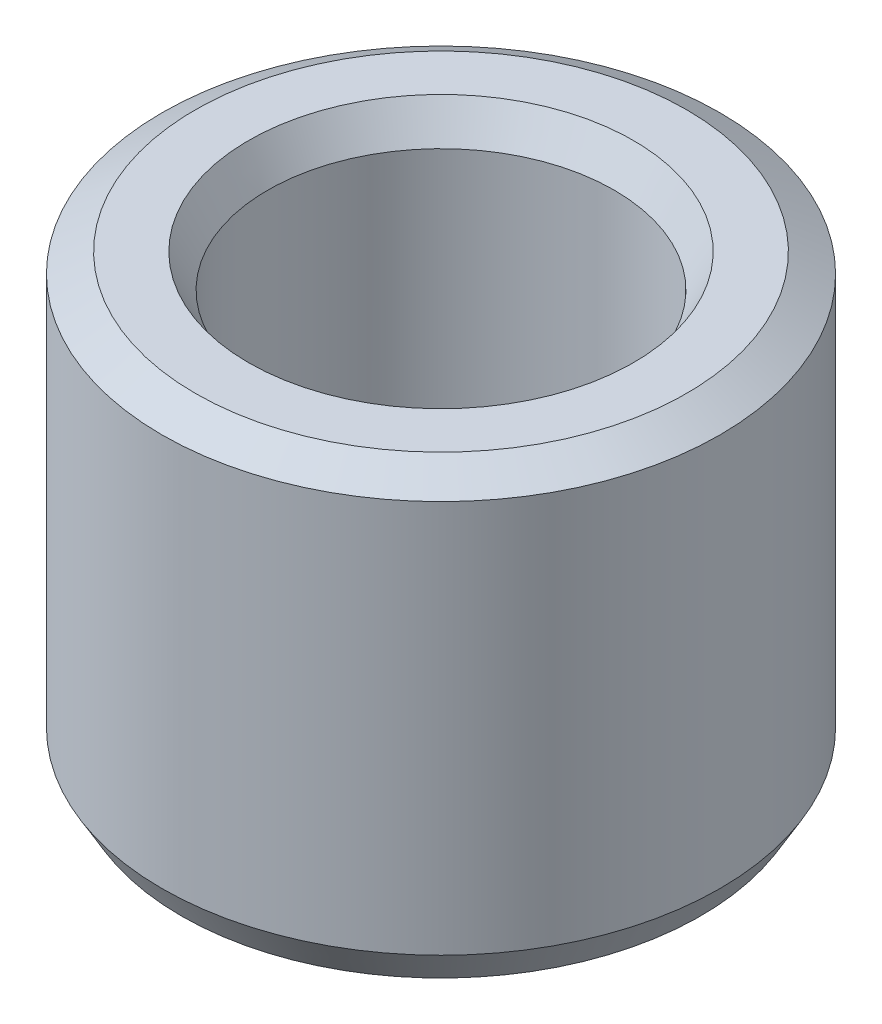
ISO-10303-21;
HEADER;
FILE_DESCRIPTION(('STEP AP214'),'2;1');
FILE_NAME('part.step','',(''),(''),'','','');
FILE_SCHEMA(('AUTOMOTIVE_DESIGN { 1 0 10303 214 1 1 1 1 }'));
ENDSEC;
DATA;
#1=APPLICATION_CONTEXT('core data for automotive mechanical design processes');
#2=APPLICATION_PROTOCOL_DEFINITION('international standard','automotive_design',2000,#1);
#3=PRODUCT_CONTEXT('',#1,'mechanical');
#4=PRODUCT('Part','Part','',(#3));
#5=PRODUCT_RELATED_PRODUCT_CATEGORY('part','',(#4));
#6=PRODUCT_DEFINITION_FORMATION('','',#4);
#7=PRODUCT_DEFINITION_CONTEXT('part definition',#1,'design');
#8=PRODUCT_DEFINITION('design','',#6,#7);
#9=PRODUCT_DEFINITION_SHAPE('','',#8);
#10=(LENGTH_UNIT() NAMED_UNIT(*) SI_UNIT(.MILLI.,.METRE.));
#11=(NAMED_UNIT(*) PLANE_ANGLE_UNIT() SI_UNIT($,.RADIAN.));
#12=(NAMED_UNIT(*) SI_UNIT($,.STERADIAN.) SOLID_ANGLE_UNIT());
#13=UNCERTAINTY_MEASURE_WITH_UNIT(LENGTH_MEASURE(1.E-05),#10,'distance_accuracy_value','');
#14=(GEOMETRIC_REPRESENTATION_CONTEXT(3) GLOBAL_UNCERTAINTY_ASSIGNED_CONTEXT((#13)) GLOBAL_UNIT_ASSIGNED_CONTEXT((#10,
#11,#12)) REPRESENTATION_CONTEXT('',''));
#15=CARTESIAN_POINT('',(0.,0.,0.));
#16=DIRECTION('',(0.,0.,1.));
#17=DIRECTION('',(1.,0.,0.));
#18=AXIS2_PLACEMENT_3D('',#15,#16,#17);
#19=CARTESIAN_POINT('',(0.,39.9164613721389,0.));
#20=DIRECTION('',(0.,-1.,0.));
#21=DIRECTION('',(0.,0.,-1.));
#22=AXIS2_PLACEMENT_3D('',#19,#20,#21);
#23=CYLINDRICAL_SURFACE('',#22,25.);
#24=CARTESIAN_POINT('',(0.,2.98852457543011,0.));
#25=DIRECTION('',(0.,1.,0.));
#26=DIRECTION('',(0.,0.,1.));
#27=AXIS2_PLACEMENT_3D('',#24,#25,#26);
#28=CIRCLE('',#27,25.);
#29=CARTESIAN_POINT('',(0.,2.98852457543011,25.));
#30=VERTEX_POINT('',#29);
#31=EDGE_CURVE('E10',#30,#30,#28,.T.);
#32=ORIENTED_EDGE('',*,*,#31,.T.);
#33=EDGE_LOOP('',(#32));
#34=FACE_BOUND('',#33,.T.);
#35=CARTESIAN_POINT('',(0.,38.1910359040345,0.));
#36=DIRECTION('',(0.,1.,0.));
#37=DIRECTION('',(0.,0.,1.));
#38=AXIS2_PLACEMENT_3D('',#35,#36,#37);
#39=CIRCLE('',#38,25.);
#40=CARTESIAN_POINT('',(0.,38.1910359040345,-25.));
#41=VERTEX_POINT('',#40);
#42=EDGE_CURVE('E50',#41,#41,#39,.F.);
#43=ORIENTED_EDGE('',*,*,#42,.T.);
#44=EDGE_LOOP('',(#43));
#45=FACE_BOUND('',#44,.T.);
#46=ADVANCED_FACE('F39',(#34,#45),#23,.T.);
#47=CARTESIAN_POINT('',(0.,39.9164613721389,0.));
#48=DIRECTION('',(0.,1.,0.));
#49=DIRECTION('',(0.,0.,1.));
#50=AXIS2_PLACEMENT_3D('',#47,#48,#49);
#51=PLANE('',#50);
#52=CARTESIAN_POINT('',(0.,39.9164613721389,0.));
#53=DIRECTION('',(0.,1.,0.));
#54=DIRECTION('',(0.,0.,1.));
#55=AXIS2_PLACEMENT_3D('',#52,#53,#54);
#56=CIRCLE('',#55,17.2464005370446);
#57=CARTESIAN_POINT('',(0.,39.9164613721389,17.2464005370446));
#58=VERTEX_POINT('',#57);
#59=EDGE_CURVE('E58',#58,#58,#56,.F.);
#60=ORIENTED_EDGE('',*,*,#59,.T.);
#61=EDGE_LOOP('',(#60));
#62=FACE_BOUND('',#61,.T.);
#63=CARTESIAN_POINT('',(0.,39.9164613721389,0.));
#64=DIRECTION('',(0.,1.,0.));
#65=DIRECTION('',(0.,0.,1.));
#66=AXIS2_PLACEMENT_3D('',#63,#64,#65);
#67=CIRCLE('',#66,22.0114754245699);
#68=CARTESIAN_POINT('',(0.,39.9164613721389,-22.0114754245699));
#69=VERTEX_POINT('',#68);
#70=EDGE_CURVE('E61',#69,#69,#67,.T.);
#71=ORIENTED_EDGE('',*,*,#70,.T.);
#72=EDGE_LOOP('',(#71));
#73=FACE_BOUND('',#72,.T.);
#74=ADVANCED_FACE('F88',(#62,#73),#51,.T.);
#75=CARTESIAN_POINT('',(0.,0.,0.));
#76=DIRECTION('',(0.,1.,0.));
#77=DIRECTION('',(0.,0.,1.));
#78=AXIS2_PLACEMENT_3D('',#75,#76,#77);
#79=PLANE('',#78);
#80=CARTESIAN_POINT('',(0.,0.,0.));
#81=DIRECTION('',(0.,1.,0.));
#82=DIRECTION('',(0.,0.,1.));
#83=AXIS2_PLACEMENT_3D('',#80,#81,#82);
#84=CIRCLE('',#83,18.5094996443703);
#85=CARTESIAN_POINT('',(0.,0.,-18.5094996443703));
#86=VERTEX_POINT('',#85);
#87=EDGE_CURVE('E51',#86,#86,#84,.T.);
#88=ORIENTED_EDGE('',*,*,#87,.T.);
#89=EDGE_LOOP('',(#88));
#90=FACE_BOUND('',#89,.T.);
#91=CARTESIAN_POINT('',(0.,0.,0.));
#92=DIRECTION('',(0.,1.,0.));
#93=DIRECTION('',(0.,0.,1.));
#94=AXIS2_PLACEMENT_3D('',#91,#92,#93);
#95=CIRCLE('',#94,23.2745745318956);
#96=CARTESIAN_POINT('',(0.,0.,23.2745745318956));
#97=VERTEX_POINT('',#96);
#98=EDGE_CURVE('E54',#97,#97,#95,.F.);
#99=ORIENTED_EDGE('',*,*,#98,.T.);
#100=EDGE_LOOP('',(#99));
#101=FACE_BOUND('',#100,.T.);
#102=ADVANCED_FACE('F83',(#90,#101),#79,.F.);
#103=CARTESIAN_POINT('',(0.,39.9164613721389,0.));
#104=DIRECTION('',(0.,-1.,0.));
#105=DIRECTION('',(0.,0.,-1.));
#106=AXIS2_PLACEMENT_3D('',#103,#104,#105);
#107=CYLINDRICAL_SURFACE('',#106,15.5209750689402);
#108=CARTESIAN_POINT('',(0.,36.9279367967088,0.));
#109=DIRECTION('',(0.,1.,0.));
#110=DIRECTION('',(0.,0.,1.));
#111=AXIS2_PLACEMENT_3D('',#108,#109,#110);
#112=CIRCLE('',#111,15.5209750689402);
#113=CARTESIAN_POINT('',(0.,36.9279367967088,15.5209750689402));
#114=VERTEX_POINT('',#113);
#115=EDGE_CURVE('E67',#114,#114,#112,.T.);
#116=ORIENTED_EDGE('',*,*,#115,.T.);
#117=EDGE_LOOP('',(#116));
#118=FACE_BOUND('',#117,.T.);
#119=CARTESIAN_POINT('',(0.,1.7254254681044,0.));
#120=DIRECTION('',(0.,1.,0.));
#121=DIRECTION('',(0.,0.,1.));
#122=AXIS2_PLACEMENT_3D('',#119,#120,#121);
#123=CIRCLE('',#122,15.5209750689402);
#124=CARTESIAN_POINT('',(0.,1.7254254681044,-15.5209750689402));
#125=VERTEX_POINT('',#124);
#126=EDGE_CURVE('E69',#125,#125,#123,.F.);
#127=ORIENTED_EDGE('',*,*,#126,.T.);
#128=EDGE_LOOP('',(#127));
#129=FACE_BOUND('',#128,.T.);
#130=ADVANCED_FACE('F71',(#118,#129),#107,.F.);
#131=CARTESIAN_POINT('',(0.,36.9279367967088,0.));
#132=DIRECTION('',(0.,1.,0.));
#133=DIRECTION('',(0.,0.,1.));
#134=AXIS2_PLACEMENT_3D('',#131,#132,#133);
#135=CONICAL_SURFACE('',#134,15.5209750689402,0.523598775598301);
#136=ORIENTED_EDGE('',*,*,#59,.F.);
#137=EDGE_LOOP('',(#136));
#138=FACE_BOUND('',#137,.T.);
#139=ORIENTED_EDGE('',*,*,#115,.F.);
#140=EDGE_LOOP('',(#139));
#141=FACE_BOUND('',#140,.T.);
#142=ADVANCED_FACE('F77',(#138,#141),#135,.F.);
#143=CARTESIAN_POINT('',(0.,0.,0.));
#144=DIRECTION('',(0.,-1.,0.));
#145=DIRECTION('',(0.,0.,-1.));
#146=AXIS2_PLACEMENT_3D('',#143,#144,#145);
#147=CONICAL_SURFACE('',#146,18.5094996443703,1.04719755119659);
#148=CARTESIAN_POINT('',(0.,1.7254254681044,-15.5209750689402));
#149=CARTESIAN_POINT('',(0.,1.70745228614498,-15.5521055332676));
#150=CARTESIAN_POINT('',(0.,1.68947910418556,-15.583235997595));
#151=CARTESIAN_POINT('',(0.,1.65353274026671,-15.6454969262497));
#152=CARTESIAN_POINT('',(0.,1.63555955830729,-15.6766273905771));
#153=CARTESIAN_POINT('',(0.,1.59961319438845,-15.7388883192319));
#154=CARTESIAN_POINT('',(0.,1.58164001242903,-15.7700187835593));
#155=CARTESIAN_POINT('',(0.,1.54569364851019,-15.8322797122141));
#156=CARTESIAN_POINT('',(0.,1.52772046655077,-15.8634101765415));
#157=CARTESIAN_POINT('',(0.,1.49177410263193,-15.9256711051963));
#158=CARTESIAN_POINT('',(0.,1.47380092067251,-15.9568015695237));
#159=CARTESIAN_POINT('',(0.,1.43785455675366,-16.0190624981785));
#160=CARTESIAN_POINT('',(0.,1.41988137479424,-16.0501929625059));
#161=CARTESIAN_POINT('',(0.,1.3839350108754,-16.1124538911607));
#162=CARTESIAN_POINT('',(0.,1.36596182891598,-16.1435843554881));
#163=CARTESIAN_POINT('',(0.,1.33001546499714,-16.2058452841429));
#164=CARTESIAN_POINT('',(0.,1.31204228303772,-16.2369757484703));
#165=CARTESIAN_POINT('',(0.,1.27609591911888,-16.2992366771251));
#166=CARTESIAN_POINT('',(0.,1.25812273715946,-16.3303671414525));
#167=CARTESIAN_POINT('',(0.,1.22217637324062,-16.3926280701073));
#168=CARTESIAN_POINT('',(0.,1.20420319128119,-16.4237585344347));
#169=CARTESIAN_POINT('',(0.,1.16825682736235,-16.4860194630895));
#170=CARTESIAN_POINT('',(0.,1.15028364540293,-16.5171499274169));
#171=CARTESIAN_POINT('',(0.,1.11433728148409,-16.5794108560717));
#172=CARTESIAN_POINT('',(0.,1.09636409952467,-16.6105413203991));
#173=CARTESIAN_POINT('',(0.,1.06041773560583,-16.6728022490538));
#174=CARTESIAN_POINT('',(0.,1.04244455364641,-16.7039327133812));
#175=CARTESIAN_POINT('',(0.,1.00649818972757,-16.766193642036));
#176=CARTESIAN_POINT('',(0.,0.988525007768145,-16.7973241063634));
#177=CARTESIAN_POINT('',(0.,0.952578643849303,-16.8595850350182));
#178=CARTESIAN_POINT('',(0.,0.934605461889882,-16.8907154993456));
#179=CARTESIAN_POINT('',(0.,0.89865909797104,-16.9529764280004));
#180=CARTESIAN_POINT('',(0.,0.88068591601162,-16.9841068923278));
#181=CARTESIAN_POINT('',(0.,0.844739552092778,-17.0463678209826));
#182=CARTESIAN_POINT('',(0.,0.826766370133357,-17.07749828531));
#183=CARTESIAN_POINT('',(0.,0.790820006214516,-17.1397592139648));
#184=CARTESIAN_POINT('',(0.,0.772846824255095,-17.1708896782922));
#185=CARTESIAN_POINT('',(0.,0.736900460336253,-17.233150606947));
#186=CARTESIAN_POINT('',(0.,0.718927278376833,-17.2642810712744));
#187=CARTESIAN_POINT('',(0.,0.682980914457991,-17.3265419999292));
#188=CARTESIAN_POINT('',(0.,0.66500773249857,-17.3576724642566));
#189=CARTESIAN_POINT('',(0.,0.629061368579728,-17.4199333929114));
#190=CARTESIAN_POINT('',(0.,0.611088186620308,-17.4510638572388));
#191=CARTESIAN_POINT('',(0.,0.575141822701466,-17.5133247858936));
#192=CARTESIAN_POINT('',(0.,0.557168640742045,-17.544455250221));
#193=CARTESIAN_POINT('',(0.,0.521222276823204,-17.6067161788758));
#194=CARTESIAN_POINT('',(0.,0.503249094863783,-17.6378466432032));
#195=CARTESIAN_POINT('',(0.,0.467302730944941,-17.7001075718579));
#196=CARTESIAN_POINT('',(0.,0.44932954898552,-17.7312380361853));
#197=CARTESIAN_POINT('',(0.,0.413383185066678,-17.7934989648401));
#198=CARTESIAN_POINT('',(0.,0.395410003107258,-17.8246294291675));
#199=CARTESIAN_POINT('',(0.,0.359463639188417,-17.8868903578223));
#200=CARTESIAN_POINT('',(0.,0.341490457228996,-17.9180208221497));
#201=CARTESIAN_POINT('',(0.,0.305544093310154,-17.9802817508045));
#202=CARTESIAN_POINT('',(0.,0.287570911350733,-18.0114122151319));
#203=CARTESIAN_POINT('',(0.,0.251624547431891,-18.0736731437867));
#204=CARTESIAN_POINT('',(0.,0.233651365472471,-18.1048036081141));
#205=CARTESIAN_POINT('',(0.,0.197705001553629,-18.1670645367689));
#206=CARTESIAN_POINT('',(0.,0.179731819594208,-18.1981950010963));
#207=CARTESIAN_POINT('',(0.,0.143785455675366,-18.2604559297511));
#208=CARTESIAN_POINT('',(0.,0.125812273715946,-18.2915863940785));
#209=CARTESIAN_POINT('',(0.,0.0898659097971044,-18.3538473227333));
#210=CARTESIAN_POINT('',(0.,0.0718927278376834,-18.3849777870607));
#211=CARTESIAN_POINT('',(0.,0.0359463639188415,-18.4472387157155));
#212=CARTESIAN_POINT('',(0.,0.0179731819594205,-18.4783691800429));
#213=CARTESIAN_POINT('',(0.,0.,-18.5094996443703));
#214=B_SPLINE_CURVE_WITH_KNOTS('',3,(#148,#149,#150,#151,#152,#153,#154,#155,#156,#157,#158,
#159,#160,#161,#162,#163,#164,#165,#166,#167,#168,#169,#170,#171,#172,#173,#174,#175,#176,#177,
#178,#179,#180,#181,#182,#183,#184,#185,#186,#187,#188,#189,#190,#191,#192,#193,#194,#195,#196,
#197,#198,#199,#200,#201,#202,#203,#204,#205,#206,#207,#208,#209,#210,#211,#212,#213),
.UNSPECIFIED.,.F.,.F.,(4,2,2,2,2,2,2,2,2,2,2,2,2,2,2,2,2,2,2,2,2,2,2,2,2,2,2,2,2,2,2,2,4),(0.,
0.107839091756524,0.215678183513047,0.323517275269574,0.431356367026098,0.539195458782621,
0.647034550539145,0.754873642295668,0.862712734052195,0.970551825808719,1.07839091756524,
1.18623000932177,1.29406910107829,1.40190819283481,1.50974728459134,1.61758637634786,
1.72542546810439,1.83326455986091,1.94110365161743,2.04894274337396,2.15678183513048,
2.26462092688701,2.37246001864353,2.48029911040005,2.58813820215658,2.69597729391311,
2.80381638566963,2.91165547742615,3.01949456918268,3.1273336609392,3.23517275269573,
3.34301184445225,3.45085093620877),.UNSPECIFIED.);
#215=EDGE_CURVE('BSEAM73',#125,#86,#214,.T.);
#216=ORIENTED_EDGE('',*,*,#126,.F.);
#217=ORIENTED_EDGE('',*,*,#87,.F.);
#218=ORIENTED_EDGE('',*,*,#215,.T.);
#219=ORIENTED_EDGE('',*,*,#215,.F.);
#220=EDGE_LOOP('',(#216,#218,#217,#219));
#221=FACE_BOUND('',#220,.T.);
#222=ADVANCED_FACE('F73',(#221),#147,.F.);
#223=CARTESIAN_POINT('',(0.,2.98852457543011,0.));
#224=DIRECTION('',(0.,1.,0.));
#225=DIRECTION('',(0.,0.,1.));
#226=AXIS2_PLACEMENT_3D('',#223,#224,#225);
#227=CONICAL_SURFACE('',#226,25.,0.523598775598303);
#228=ORIENTED_EDGE('',*,*,#98,.F.);
#229=EDGE_LOOP('',(#228));
#230=FACE_BOUND('',#229,.T.);
#231=ORIENTED_EDGE('',*,*,#31,.F.);
#232=EDGE_LOOP('',(#231));
#233=FACE_BOUND('',#232,.T.);
#234=ADVANCED_FACE('F76',(#230,#233),#227,.T.);
#235=CARTESIAN_POINT('',(0.,39.9164613721389,0.));
#236=DIRECTION('',(0.,-1.,0.));
#237=DIRECTION('',(0.,0.,-1.));
#238=AXIS2_PLACEMENT_3D('',#235,#236,#237);
#239=CONICAL_SURFACE('',#238,22.0114754245699,1.04719755119659);
#240=CARTESIAN_POINT('',(0.,38.1910359040345,-25.));
#241=CARTESIAN_POINT('',(0.,38.2090090859939,-24.9688695356726));
#242=CARTESIAN_POINT('',(0.,38.2269822679534,-24.9377390713452));
#243=CARTESIAN_POINT('',(0.,38.2629286318722,-24.8754781426904));
#244=CARTESIAN_POINT('',(0.,38.2809018138316,-24.844347678363));
#245=CARTESIAN_POINT('',(0.,38.3168481777505,-24.7820867497082));
#246=CARTESIAN_POINT('',(0.,38.3348213597099,-24.7509562853808));
#247=CARTESIAN_POINT('',(0.,38.3707677236287,-24.688695356726));
#248=CARTESIAN_POINT('',(0.,38.3887409055882,-24.6575648923986));
#249=CARTESIAN_POINT('',(0.,38.424687269507,-24.5953039637438));
#250=CARTESIAN_POINT('',(0.,38.4426604514664,-24.5641734994165));
#251=CARTESIAN_POINT('',(0.,38.4786068153853,-24.5019125707617));
#252=CARTESIAN_POINT('',(0.,38.4965799973447,-24.4707821064343));
#253=CARTESIAN_POINT('',(0.,38.5325263612635,-24.4085211777795));
#254=CARTESIAN_POINT('',(0.,38.5504995432229,-24.3773907134521));
#255=CARTESIAN_POINT('',(0.,38.5864459071418,-24.3151297847973));
#256=CARTESIAN_POINT('',(0.,38.6044190891012,-24.2839993204699));
#257=CARTESIAN_POINT('',(0.,38.64036545302,-24.2217383918151));
#258=CARTESIAN_POINT('',(0.,38.6583386349795,-24.1906079274877));
#259=CARTESIAN_POINT('',(0.,38.6942849988983,-24.1283469988329));
#260=CARTESIAN_POINT('',(0.,38.7122581808577,-24.0972165345055));
#261=CARTESIAN_POINT('',(0.,38.7482045447766,-24.0349556058507));
#262=CARTESIAN_POINT('',(0.,38.766177726736,-24.0038251415233));
#263=CARTESIAN_POINT('',(0.,38.8021240906548,-23.9415642128685));
#264=CARTESIAN_POINT('',(0.,38.8200972726143,-23.9104337485411));
#265=CARTESIAN_POINT('',(0.,38.8560436365331,-23.8481728198863));
#266=CARTESIAN_POINT('',(0.,38.8740168184925,-23.8170423555589));
#267=CARTESIAN_POINT('',(0.,38.9099631824114,-23.7547814269041));
#268=CARTESIAN_POINT('',(0.,38.9279363643708,-23.7236509625767));
#269=CARTESIAN_POINT('',(0.,38.9638827282896,-23.6613900339219));
#270=CARTESIAN_POINT('',(0.,38.981855910249,-23.6302595695945));
#271=CARTESIAN_POINT('',(0.,39.0178022741679,-23.5679986409397));
#272=CARTESIAN_POINT('',(0.,39.0357754561273,-23.5368681766124));
#273=CARTESIAN_POINT('',(0.,39.0717218200462,-23.4746072479576));
#274=CARTESIAN_POINT('',(0.,39.0896950020056,-23.4434767836302));
#275=CARTESIAN_POINT('',(0.,39.1256413659244,-23.3812158549754));
#276=CARTESIAN_POINT('',(0.,39.1436145478838,-23.350085390648));
#277=CARTESIAN_POINT('',(0.,39.1795609118027,-23.2878244619932));
#278=CARTESIAN_POINT('',(0.,39.1975340937621,-23.2566939976658));
#279=CARTESIAN_POINT('',(0.,39.2334804576809,-23.194433069011));
#280=CARTESIAN_POINT('',(0.,39.2514536396404,-23.1633026046836));
#281=CARTESIAN_POINT('',(0.,39.2874000035592,-23.1010416760288));
#282=CARTESIAN_POINT('',(0.,39.3053731855186,-23.0699112117014));
#283=CARTESIAN_POINT('',(0.,39.3413195494375,-23.0076502830466));
#284=CARTESIAN_POINT('',(0.,39.3592927313969,-22.9765198187192));
#285=CARTESIAN_POINT('',(0.,39.3952390953157,-22.9142588900644));
#286=CARTESIAN_POINT('',(0.,39.4132122772751,-22.883128425737));
#287=CARTESIAN_POINT('',(0.,39.449158641194,-22.8208674970822));
#288=CARTESIAN_POINT('',(0.,39.4671318231534,-22.7897370327548));
#289=CARTESIAN_POINT('',(0.,39.5030781870722,-22.7274761041));
#290=CARTESIAN_POINT('',(0.,39.5210513690317,-22.6963456397726));
#291=CARTESIAN_POINT('',(0.,39.5569977329505,-22.6340847111178));
#292=CARTESIAN_POINT('',(0.,39.5749709149099,-22.6029542467904));
#293=CARTESIAN_POINT('',(0.,39.6109172788288,-22.5406933181356));
#294=CARTESIAN_POINT('',(0.,39.6288904607882,-22.5095628538083));
#295=CARTESIAN_POINT('',(0.,39.664836824707,-22.4473019251535));
#296=CARTESIAN_POINT('',(0.,39.6828100066665,-22.4161714608261));
#297=CARTESIAN_POINT('',(0.,39.7187563705853,-22.3539105321713));
#298=CARTESIAN_POINT('',(0.,39.7367295525447,-22.3227800678439));
#299=CARTESIAN_POINT('',(0.,39.7726759164636,-22.2605191391891));
#300=CARTESIAN_POINT('',(0.,39.790649098423,-22.2293886748617));
#301=CARTESIAN_POINT('',(0.,39.8265954623418,-22.1671277462069));
#302=CARTESIAN_POINT('',(0.,39.8445686443012,-22.1359972818795));
#303=CARTESIAN_POINT('',(0.,39.8805150082201,-22.0737363532247));
#304=CARTESIAN_POINT('',(0.,39.8984881901795,-22.0426058888973));
#305=CARTESIAN_POINT('',(0.,39.9164613721389,-22.0114754245699));
#306=B_SPLINE_CURVE_WITH_KNOTS('',3,(#240,#241,#242,#243,#244,#245,#246,#247,#248,#249,#250,
#251,#252,#253,#254,#255,#256,#257,#258,#259,#260,#261,#262,#263,#264,#265,#266,#267,#268,#269,
#270,#271,#272,#273,#274,#275,#276,#277,#278,#279,#280,#281,#282,#283,#284,#285,#286,#287,#288,
#289,#290,#291,#292,#293,#294,#295,#296,#297,#298,#299,#300,#301,#302,#303,#304,#305),
.UNSPECIFIED.,.F.,.F.,(4,2,2,2,2,2,2,2,2,2,2,2,2,2,2,2,2,2,2,2,2,2,2,2,2,2,2,2,2,2,2,2,4),(0.,
0.107839091756525,0.21567818351305,0.323517275269572,0.431356367026097,0.539195458782619,
0.647034550539144,0.754873642295669,0.862712734052194,0.970551825808716,1.07839091756524,
1.18623000932176,1.29406910107829,1.40190819283481,1.50974728459134,1.61758637634786,
1.72542546810439,1.83326455986091,1.94110365161744,2.04894274337396,2.15678183513048,
2.26462092688701,2.37246001864353,2.48029911040006,2.58813820215658,2.69597729391311,
2.80381638566963,2.91165547742615,3.01949456918268,3.1273336609392,3.23517275269572,
3.34301184445225,3.45085093620878),.UNSPECIFIED.);
#307=EDGE_CURVE('BSEAM45',#41,#69,#306,.T.);
#308=ORIENTED_EDGE('',*,*,#42,.F.);
#309=ORIENTED_EDGE('',*,*,#70,.F.);
#310=ORIENTED_EDGE('',*,*,#307,.T.);
#311=ORIENTED_EDGE('',*,*,#307,.F.);
#312=EDGE_LOOP('',(#308,#310,#309,#311));
#313=FACE_BOUND('',#312,.T.);
#314=ADVANCED_FACE('F45',(#313),#239,.T.);
#315=CLOSED_SHELL('',(#46,#74,#102,#130,#142,#222,#234,#314));
#316=MANIFOLD_SOLID_BREP('B2',#315);
#317=ADVANCED_BREP_SHAPE_REPRESENTATION('',(#18,#316),#14);
#318=SHAPE_DEFINITION_REPRESENTATION(#9,#317);
ENDSEC;
END-ISO-10303-21;
